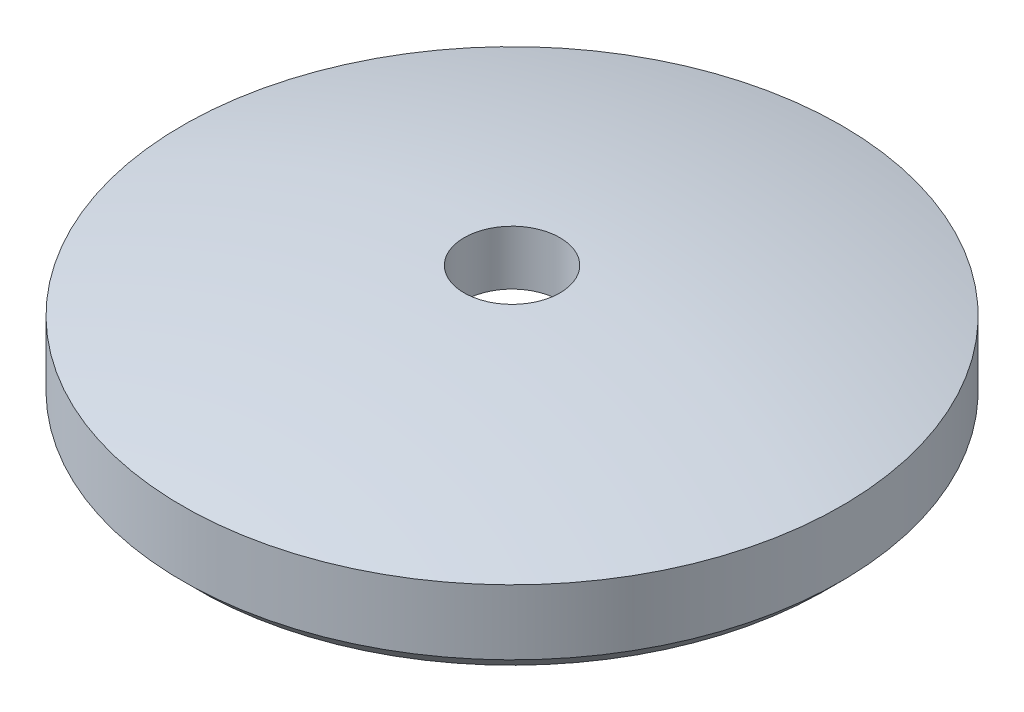
ISO-10303-21;
HEADER;
FILE_DESCRIPTION(('STEP AP214'),'2;1');
FILE_NAME('part.step','',(''),(''),'','','');
FILE_SCHEMA(('AUTOMOTIVE_DESIGN { 1 0 10303 214 1 1 1 1 }'));
ENDSEC;
DATA;
#1=APPLICATION_CONTEXT('core data for automotive mechanical design processes');
#2=APPLICATION_PROTOCOL_DEFINITION('international standard','automotive_design',2000,#1);
#3=PRODUCT_CONTEXT('',#1,'mechanical');
#4=PRODUCT('Part','Part','',(#3));
#5=PRODUCT_RELATED_PRODUCT_CATEGORY('part','',(#4));
#6=PRODUCT_DEFINITION_FORMATION('','',#4);
#7=PRODUCT_DEFINITION_CONTEXT('part definition',#1,'design');
#8=PRODUCT_DEFINITION('design','',#6,#7);
#9=PRODUCT_DEFINITION_SHAPE('','',#8);
#10=(LENGTH_UNIT() NAMED_UNIT(*) SI_UNIT(.MILLI.,.METRE.));
#11=(NAMED_UNIT(*) PLANE_ANGLE_UNIT() SI_UNIT($,.RADIAN.));
#12=(NAMED_UNIT(*) SI_UNIT($,.STERADIAN.) SOLID_ANGLE_UNIT());
#13=UNCERTAINTY_MEASURE_WITH_UNIT(LENGTH_MEASURE(1.E-05),#10,'distance_accuracy_value','');
#14=(GEOMETRIC_REPRESENTATION_CONTEXT(3) GLOBAL_UNCERTAINTY_ASSIGNED_CONTEXT((#13)) GLOBAL_UNIT_ASSIGNED_CONTEXT((#10,
#11,#12)) REPRESENTATION_CONTEXT('',''));
#15=CARTESIAN_POINT('',(0.,0.,0.));
#16=DIRECTION('',(0.,0.,1.));
#17=DIRECTION('',(1.,0.,0.));
#18=AXIS2_PLACEMENT_3D('',#15,#16,#17);
#19=CARTESIAN_POINT('',(0.,-1.40231846955418,0.));
#20=DIRECTION('',(0.,-1.,0.));
#21=DIRECTION('',(1.,0.,0.));
#22=AXIS2_PLACEMENT_3D('',#19,#20,#21);
#23=SPHERICAL_SURFACE('',#22,1.93376346848895);
#24=CARTESIAN_POINT('',(0.,0.53,0.));
#25=DIRECTION('',(0.,-1.,0.));
#26=DIRECTION('',(0.,0.,-1.));
#27=AXIS2_PLACEMENT_3D('',#24,#25,#26);
#28=CIRCLE('',#27,0.0747427874928716);
#29=CARTESIAN_POINT('',(0.,0.53,-0.0747427874928716));
#30=VERTEX_POINT('',#29);
#31=EDGE_CURVE('E10',#30,#30,#28,.T.);
#32=ORIENTED_EDGE('',*,*,#31,.T.);
#33=EDGE_LOOP('',(#32));
#34=FACE_BOUND('',#33,.T.);
#35=CARTESIAN_POINT('',(0.,0.461817050122692,0.));
#36=DIRECTION('',(0.,-1.,0.));
#37=DIRECTION('',(0.,0.,-1.));
#38=AXIS2_PLACEMENT_3D('',#35,#36,#37);
#39=CIRCLE('',#38,0.514237217966038);
#40=CARTESIAN_POINT('',(0.,0.461817050122692,-0.514237217966038));
#41=VERTEX_POINT('',#40);
#42=EDGE_CURVE('E52',#41,#41,#39,.T.);
#43=ORIENTED_EDGE('',*,*,#42,.F.);
#44=EDGE_LOOP('',(#43));
#45=FACE_BOUND('',#44,.T.);
#46=ADVANCED_FACE('F30',(#34,#45),#23,.T.);
#47=CARTESIAN_POINT('',(0.,0.53,0.));
#48=DIRECTION('',(0.,-1.,0.));
#49=DIRECTION('',(0.,0.,-1.));
#50=AXIS2_PLACEMENT_3D('',#47,#48,#49);
#51=CYLINDRICAL_SURFACE('',#50,0.0747427874928707);
#52=CARTESIAN_POINT('',(0.,0.444967445998631,0.));
#53=DIRECTION('',(0.,-1.,0.));
#54=DIRECTION('',(0.,0.,-1.));
#55=AXIS2_PLACEMENT_3D('',#52,#53,#54);
#56=CIRCLE('',#55,0.0747427874928698);
#57=CARTESIAN_POINT('',(0.,0.444967445998631,-0.0747427874928698));
#58=VERTEX_POINT('',#57);
#59=EDGE_CURVE('E36',#58,#58,#56,.T.);
#60=ORIENTED_EDGE('',*,*,#59,.T.);
#61=EDGE_LOOP('',(#60));
#62=FACE_BOUND('',#61,.T.);
#63=ORIENTED_EDGE('',*,*,#31,.F.);
#64=EDGE_LOOP('',(#63));
#65=FACE_BOUND('',#64,.T.);
#66=ADVANCED_FACE('F60',(#62,#65),#51,.F.);
#67=CARTESIAN_POINT('',(0.,-0.125509225699141,0.));
#68=DIRECTION('',(0.,-1.,0.));
#69=DIRECTION('',(1.,0.,0.));
#70=AXIS2_PLACEMENT_3D('',#67,#68,#69);
#71=SPHERICAL_SURFACE('',#70,0.575352168009796);
#72=CARTESIAN_POINT('',(0.,0.335444176006563,0.));
#73=DIRECTION('',(0.,-1.,0.));
#74=DIRECTION('',(0.,0.,-1.));
#75=AXIS2_PLACEMENT_3D('',#72,#73,#74);
#76=CIRCLE('',#75,0.344313924623318);
#77=CARTESIAN_POINT('',(0.,0.335444176006563,-0.344313924623318));
#78=VERTEX_POINT('',#77);
#79=EDGE_CURVE('E40',#78,#78,#76,.T.);
#80=ORIENTED_EDGE('',*,*,#79,.T.);
#81=EDGE_LOOP('',(#80));
#82=FACE_BOUND('',#81,.T.);
#83=ORIENTED_EDGE('',*,*,#59,.F.);
#84=EDGE_LOOP('',(#83));
#85=FACE_BOUND('',#84,.T.);
#86=ADVANCED_FACE('F64',(#82,#85),#71,.F.);
#87=CARTESIAN_POINT('',(0.344313924623318,0.335444176006563,0.));
#88=DIRECTION('',(0.,-1.,0.));
#89=DIRECTION('',(0.,0.,-1.));
#90=AXIS2_PLACEMENT_3D('',#87,#88,#89);
#91=PLANE('',#90);
#92=CARTESIAN_POINT('',(0.,0.335444176006563,0.));
#93=DIRECTION('',(0.,-1.,0.));
#94=DIRECTION('',(0.,0.,-1.));
#95=AXIS2_PLACEMENT_3D('',#92,#93,#94);
#96=CIRCLE('',#95,0.489237217966038);
#97=CARTESIAN_POINT('',(0.,0.335444176006563,-0.489237217966038));
#98=VERTEX_POINT('',#97);
#99=EDGE_CURVE('E44',#98,#98,#96,.T.);
#100=ORIENTED_EDGE('',*,*,#99,.T.);
#101=EDGE_LOOP('',(#100));
#102=FACE_BOUND('',#101,.T.);
#103=ORIENTED_EDGE('',*,*,#79,.F.);
#104=EDGE_LOOP('',(#103));
#105=FACE_BOUND('',#104,.T.);
#106=ADVANCED_FACE('F68',(#102,#105),#91,.T.);
#107=CARTESIAN_POINT('',(0.,0.335444176006563,0.));
#108=DIRECTION('',(0.,1.,0.));
#109=DIRECTION('',(0.,0.,1.));
#110=AXIS2_PLACEMENT_3D('',#107,#108,#109);
#111=CONICAL_SURFACE('',#110,0.489237217966038,0.785398163397448);
#112=CARTESIAN_POINT('',(0.,0.360444176006563,0.));
#113=DIRECTION('',(0.,-1.,0.));
#114=DIRECTION('',(0.,0.,-1.));
#115=AXIS2_PLACEMENT_3D('',#112,#113,#114);
#116=CIRCLE('',#115,0.514237217966038);
#117=CARTESIAN_POINT('',(0.,0.360444176006563,-0.514237217966038));
#118=VERTEX_POINT('',#117);
#119=EDGE_CURVE('E49',#118,#118,#116,.T.);
#120=ORIENTED_EDGE('',*,*,#119,.T.);
#121=EDGE_LOOP('',(#120));
#122=FACE_BOUND('',#121,.T.);
#123=ORIENTED_EDGE('',*,*,#99,.F.);
#124=EDGE_LOOP('',(#123));
#125=FACE_BOUND('',#124,.T.);
#126=ADVANCED_FACE('F75',(#122,#125),#111,.T.);
#127=CARTESIAN_POINT('',(0.,0.53,0.));
#128=DIRECTION('',(0.,-1.,0.));
#129=DIRECTION('',(0.,0.,-1.));
#130=AXIS2_PLACEMENT_3D('',#127,#128,#129);
#131=CYLINDRICAL_SURFACE('',#130,0.514237217966038);
#132=ORIENTED_EDGE('',*,*,#42,.T.);
#133=EDGE_LOOP('',(#132));
#134=FACE_BOUND('',#133,.T.);
#135=ORIENTED_EDGE('',*,*,#119,.F.);
#136=EDGE_LOOP('',(#135));
#137=FACE_BOUND('',#136,.T.);
#138=ADVANCED_FACE('F56',(#134,#137),#131,.T.);
#139=CLOSED_SHELL('',(#46,#66,#86,#106,#126,#138));
#140=MANIFOLD_SOLID_BREP('B2',#139);
#141=ADVANCED_BREP_SHAPE_REPRESENTATION('',(#18,#140),#14);
#142=SHAPE_DEFINITION_REPRESENTATION(#9,#141);
ENDSEC;
END-ISO-10303-21;
